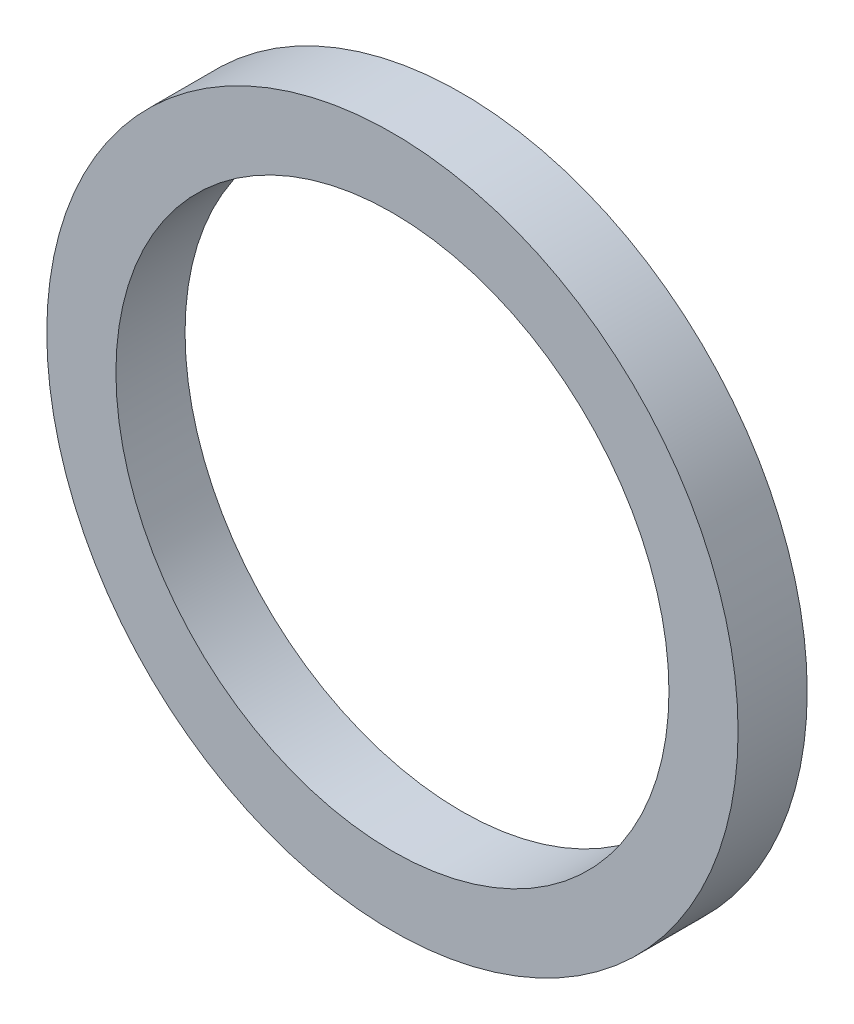
ISO-10303-21;
HEADER;
FILE_DESCRIPTION(('STEP AP214'),'2;1');
FILE_NAME('part.step','',(''),(''),'','','');
FILE_SCHEMA(('AUTOMOTIVE_DESIGN { 1 0 10303 214 1 1 1 1 }'));
ENDSEC;
DATA;
#1=APPLICATION_CONTEXT('core data for automotive mechanical design processes');
#2=APPLICATION_PROTOCOL_DEFINITION('international standard','automotive_design',2000,#1);
#3=PRODUCT_CONTEXT('',#1,'mechanical');
#4=PRODUCT('Part','Part','',(#3));
#5=PRODUCT_RELATED_PRODUCT_CATEGORY('part','',(#4));
#6=PRODUCT_DEFINITION_FORMATION('','',#4);
#7=PRODUCT_DEFINITION_CONTEXT('part definition',#1,'design');
#8=PRODUCT_DEFINITION('design','',#6,#7);
#9=PRODUCT_DEFINITION_SHAPE('','',#8);
#10=(LENGTH_UNIT() NAMED_UNIT(*) SI_UNIT(.MILLI.,.METRE.));
#11=(NAMED_UNIT(*) PLANE_ANGLE_UNIT() SI_UNIT($,.RADIAN.));
#12=(NAMED_UNIT(*) SI_UNIT($,.STERADIAN.) SOLID_ANGLE_UNIT());
#13=UNCERTAINTY_MEASURE_WITH_UNIT(LENGTH_MEASURE(1.E-05),#10,'distance_accuracy_value','');
#14=(GEOMETRIC_REPRESENTATION_CONTEXT(3) GLOBAL_UNCERTAINTY_ASSIGNED_CONTEXT((#13)) GLOBAL_UNIT_ASSIGNED_CONTEXT((#10,
#11,#12)) REPRESENTATION_CONTEXT('',''));
#15=CARTESIAN_POINT('',(0.,0.,0.));
#16=DIRECTION('',(0.,0.,1.));
#17=DIRECTION('',(1.,0.,0.));
#18=AXIS2_PLACEMENT_3D('',#15,#16,#17);
#19=CARTESIAN_POINT('',(0.,0.,10.));
#20=DIRECTION('',(0.,0.,1.));
#21=DIRECTION('',(1.,0.,0.));
#22=AXIS2_PLACEMENT_3D('',#19,#20,#21);
#23=PLANE('',#22);
#24=CARTESIAN_POINT('',(0.,0.,10.));
#25=DIRECTION('',(0.,0.,1.));
#26=DIRECTION('',(1.,0.,0.));
#27=AXIS2_PLACEMENT_3D('',#24,#25,#26);
#28=CIRCLE('',#27,50.);
#29=CARTESIAN_POINT('',(50.,0.,10.));
#30=VERTEX_POINT('',#29);
#31=EDGE_CURVE('E10',#30,#30,#28,.T.);
#32=ORIENTED_EDGE('',*,*,#31,.T.);
#33=EDGE_LOOP('',(#32));
#34=FACE_BOUND('',#33,.T.);
#35=CARTESIAN_POINT('',(0.,0.,10.));
#36=DIRECTION('',(0.,0.,1.));
#37=DIRECTION('',(1.,0.,0.));
#38=AXIS2_PLACEMENT_3D('',#35,#36,#37);
#39=CIRCLE('',#38,40.);
#40=CARTESIAN_POINT('',(40.,0.,10.));
#41=VERTEX_POINT('',#40);
#42=EDGE_CURVE('E50',#41,#41,#39,.T.);
#43=ORIENTED_EDGE('',*,*,#42,.F.);
#44=EDGE_LOOP('',(#43));
#45=FACE_BOUND('',#44,.T.);
#46=ADVANCED_FACE('F37',(#34,#45),#23,.T.);
#47=CARTESIAN_POINT('',(0.,0.,0.));
#48=DIRECTION('',(0.,0.,1.));
#49=DIRECTION('',(1.,0.,0.));
#50=AXIS2_PLACEMENT_3D('',#47,#48,#49);
#51=PLANE('',#50);
#52=CARTESIAN_POINT('',(0.,0.,0.));
#53=DIRECTION('',(0.,0.,1.));
#54=DIRECTION('',(1.,0.,0.));
#55=AXIS2_PLACEMENT_3D('',#52,#53,#54);
#56=CIRCLE('',#55,50.);
#57=CARTESIAN_POINT('',(50.,0.,0.));
#58=VERTEX_POINT('',#57);
#59=EDGE_CURVE('E41',#58,#58,#56,.T.);
#60=ORIENTED_EDGE('',*,*,#59,.F.);
#61=EDGE_LOOP('',(#60));
#62=FACE_BOUND('',#61,.T.);
#63=CARTESIAN_POINT('',(0.,0.,0.));
#64=DIRECTION('',(0.,0.,1.));
#65=DIRECTION('',(1.,0.,0.));
#66=AXIS2_PLACEMENT_3D('',#63,#64,#65);
#67=CIRCLE('',#66,40.);
#68=CARTESIAN_POINT('',(40.,0.,0.));
#69=VERTEX_POINT('',#68);
#70=EDGE_CURVE('E52',#69,#69,#67,.T.);
#71=ORIENTED_EDGE('',*,*,#70,.T.);
#72=EDGE_LOOP('',(#71));
#73=FACE_BOUND('',#72,.T.);
#74=ADVANCED_FACE('F64',(#62,#73),#51,.F.);
#75=CARTESIAN_POINT('',(0.,0.,10.));
#76=DIRECTION('',(0.,0.,-1.));
#77=DIRECTION('',(-1.,0.,0.));
#78=AXIS2_PLACEMENT_3D('',#75,#76,#77);
#79=CYLINDRICAL_SURFACE('',#78,50.);
#80=ORIENTED_EDGE('',*,*,#31,.F.);
#81=EDGE_LOOP('',(#80));
#82=FACE_BOUND('',#81,.T.);
#83=ORIENTED_EDGE('',*,*,#59,.T.);
#84=EDGE_LOOP('',(#83));
#85=FACE_BOUND('',#84,.T.);
#86=ADVANCED_FACE('F39',(#82,#85),#79,.T.);
#87=CARTESIAN_POINT('',(0.,0.,10.));
#88=DIRECTION('',(0.,0.,-1.));
#89=DIRECTION('',(-1.,0.,0.));
#90=AXIS2_PLACEMENT_3D('',#87,#88,#89);
#91=CYLINDRICAL_SURFACE('',#90,40.);
#92=ORIENTED_EDGE('',*,*,#42,.T.);
#93=EDGE_LOOP('',(#92));
#94=FACE_BOUND('',#93,.T.);
#95=ORIENTED_EDGE('',*,*,#70,.F.);
#96=EDGE_LOOP('',(#95));
#97=FACE_BOUND('',#96,.T.);
#98=ADVANCED_FACE('F60',(#94,#97),#91,.F.);
#99=CLOSED_SHELL('',(#46,#74,#86,#98));
#100=MANIFOLD_SOLID_BREP('B2',#99);
#101=ADVANCED_BREP_SHAPE_REPRESENTATION('',(#18,#100),#14);
#102=SHAPE_DEFINITION_REPRESENTATION(#9,#101);
ENDSEC;
END-ISO-10303-21;
